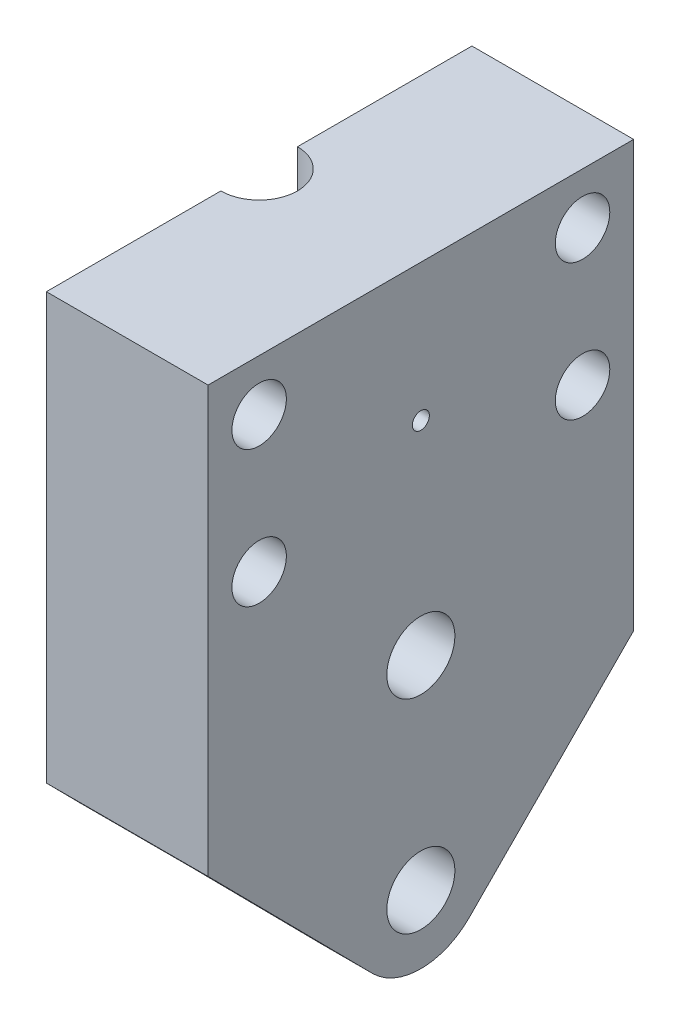
ISO-10303-21;
HEADER;
FILE_DESCRIPTION(('STEP AP214'),'2;1');
FILE_NAME('part.step','',(''),(''),'','','');
FILE_SCHEMA(('AUTOMOTIVE_DESIGN { 1 0 10303 214 1 1 1 1 }'));
ENDSEC;
DATA;
#1=APPLICATION_CONTEXT('core data for automotive mechanical design processes');
#2=APPLICATION_PROTOCOL_DEFINITION('international standard','automotive_design',2000,#1);
#3=PRODUCT_CONTEXT('',#1,'mechanical');
#4=PRODUCT('Part','Part','',(#3));
#5=PRODUCT_RELATED_PRODUCT_CATEGORY('part','',(#4));
#6=PRODUCT_DEFINITION_FORMATION('','',#4);
#7=PRODUCT_DEFINITION_CONTEXT('part definition',#1,'design');
#8=PRODUCT_DEFINITION('design','',#6,#7);
#9=PRODUCT_DEFINITION_SHAPE('','',#8);
#10=(LENGTH_UNIT() NAMED_UNIT(*) SI_UNIT(.MILLI.,.METRE.));
#11=(NAMED_UNIT(*) PLANE_ANGLE_UNIT() SI_UNIT($,.RADIAN.));
#12=(NAMED_UNIT(*) SI_UNIT($,.STERADIAN.) SOLID_ANGLE_UNIT());
#13=UNCERTAINTY_MEASURE_WITH_UNIT(LENGTH_MEASURE(1.E-05),#10,'distance_accuracy_value','');
#14=(GEOMETRIC_REPRESENTATION_CONTEXT(3) GLOBAL_UNCERTAINTY_ASSIGNED_CONTEXT((#13)) GLOBAL_UNIT_ASSIGNED_CONTEXT((#10,
#11,#12)) REPRESENTATION_CONTEXT('',''));
#15=CARTESIAN_POINT('',(0.,0.,0.));
#16=DIRECTION('',(0.,0.,1.));
#17=DIRECTION('',(1.,0.,0.));
#18=AXIS2_PLACEMENT_3D('',#15,#16,#17);
#19=CARTESIAN_POINT('',(0.,0.,0.));
#20=DIRECTION('',(1.,0.,0.));
#21=DIRECTION('',(0.,0.,-1.));
#22=AXIS2_PLACEMENT_3D('',#19,#20,#21);
#23=PLANE('',#22);
#24=CARTESIAN_POINT('',(0.,17.,-9.5));
#25=DIRECTION('',(1.,0.,0.));
#26=DIRECTION('',(0.,0.,-1.));
#27=AXIS2_PLACEMENT_3D('',#24,#25,#26);
#28=CIRCLE('',#27,1.6);
#29=CARTESIAN_POINT('',(0.,17.,-11.1));
#30=VERTEX_POINT('',#29);
#31=EDGE_CURVE('E219',#30,#30,#28,.T.);
#32=ORIENTED_EDGE('',*,*,#31,.T.);
#33=EDGE_LOOP('',(#32));
#34=FACE_BOUND('',#33,.T.);
#35=CARTESIAN_POINT('',(0.,9.,-9.5));
#36=DIRECTION('',(1.,0.,0.));
#37=DIRECTION('',(0.,0.,-1.));
#38=AXIS2_PLACEMENT_3D('',#35,#36,#37);
#39=CIRCLE('',#38,1.6);
#40=CARTESIAN_POINT('',(0.,9.,-11.1));
#41=VERTEX_POINT('',#40);
#42=EDGE_CURVE('E201',#41,#41,#39,.T.);
#43=ORIENTED_EDGE('',*,*,#42,.T.);
#44=EDGE_LOOP('',(#43));
#45=FACE_BOUND('',#44,.T.);
#46=DIRECTION('',(0.,1.,0.));
#47=VECTOR('',#46,1.);
#48=CARTESIAN_POINT('',(0.,14.,-2.25));
#49=LINE('',#48,#47);
#50=CARTESIAN_POINT('',(0.,20.,-2.25));
#51=VERTEX_POINT('',#50);
#52=CARTESIAN_POINT('',(0.,16.95,-2.25));
#53=VERTEX_POINT('',#52);
#54=EDGE_CURVE('E57',#51,#53,#49,.F.);
#55=ORIENTED_EDGE('',*,*,#54,.F.);
#56=DIRECTION('',(0.,0.,1.));
#57=VECTOR('',#56,1.);
#58=CARTESIAN_POINT('',(0.,20.,0.));
#59=LINE('',#58,#57);
#60=CARTESIAN_POINT('',(0.,20.,-12.5));
#61=VERTEX_POINT('',#60);
#62=EDGE_CURVE('E164',#61,#51,#59,.T.);
#63=ORIENTED_EDGE('',*,*,#62,.F.);
#64=DIRECTION('',(0.,1.,0.));
#65=VECTOR('',#64,1.);
#66=CARTESIAN_POINT('',(0.,0.,-12.5));
#67=LINE('',#66,#65);
#68=CARTESIAN_POINT('',(0.,-5.,-12.5));
#69=VERTEX_POINT('',#68);
#70=EDGE_CURVE('E179',#69,#61,#67,.T.);
#71=ORIENTED_EDGE('',*,*,#70,.F.);
#72=DIRECTION('',(0.,-0.710972936771414,0.703219370594007));
#73=VECTOR('',#72,1.);
#74=CARTESIAN_POINT('',(0.,-8.72221167971524,-8.81838116579595));
#75=LINE('',#74,#73);
#76=CARTESIAN_POINT('',(0.,-7.09701164045243,-10.4258574698725));
#77=VERTEX_POINT('',#76);
#78=EDGE_CURVE('E323',#69,#77,#75,.T.);
#79=ORIENTED_EDGE('',*,*,#78,.T.);
#80=CARTESIAN_POINT('',(0.,-11.95,0.));
#81=DIRECTION('',(1.,0.,0.));
#82=DIRECTION('',(0.,0.,-1.));
#83=AXIS2_PLACEMENT_3D('',#80,#81,#82);
#84=CIRCLE('',#83,11.5);
#85=CARTESIAN_POINT('',(0.,-4.62562761506277,-8.86586539299852));
#86=VERTEX_POINT('',#85);
#87=EDGE_CURVE('E281',#77,#86,#84,.T.);
#88=ORIENTED_EDGE('',*,*,#87,.T.);
#89=CARTESIAN_POINT('',(0.,0.,0.));
#90=DIRECTION('',(1.,0.,0.));
#91=DIRECTION('',(0.,0.,-1.));
#92=AXIS2_PLACEMENT_3D('',#89,#90,#91);
#93=CIRCLE('',#92,10.);
#94=CARTESIAN_POINT('',(0.,8.10889121338912,-5.85199823046971));
#95=VERTEX_POINT('',#94);
#96=EDGE_CURVE('E247',#86,#95,#93,.T.);
#97=ORIENTED_EDGE('',*,*,#96,.T.);
#98=CARTESIAN_POINT('',(0.,11.95,0.));
#99=DIRECTION('',(1.,0.,0.));
#100=DIRECTION('',(0.,0.,-1.));
#101=AXIS2_PLACEMENT_3D('',#98,#99,#100);
#102=CIRCLE('',#101,7.);
#103=CARTESIAN_POINT('',(0.,16.95,-4.89897948556636));
#104=VERTEX_POINT('',#103);
#105=EDGE_CURVE('E273',#95,#104,#102,.T.);
#106=ORIENTED_EDGE('',*,*,#105,.T.);
#107=DIRECTION('',(0.,0.,1.));
#108=VECTOR('',#107,1.);
#109=CARTESIAN_POINT('',(0.,16.95,0.));
#110=LINE('',#109,#108);
#111=EDGE_CURVE('E166',#104,#53,#110,.T.);
#112=ORIENTED_EDGE('',*,*,#111,.T.);
#113=EDGE_LOOP('',(#55,#63,#71,#79,#88,#97,#106,#112));
#114=FACE_BOUND('',#113,.T.);
#115=ADVANCED_FACE('F40',(#34,#45,#114),#23,.F.);
#116=CARTESIAN_POINT('',(0.,17.,9.5));
#117=DIRECTION('',(1.,0.,0.));
#118=DIRECTION('',(0.,0.,-1.));
#119=AXIS2_PLACEMENT_3D('',#116,#117,#118);
#120=CIRCLE('',#119,1.6);
#121=CARTESIAN_POINT('',(0.,17.,7.9));
#122=VERTEX_POINT('',#121);
#123=EDGE_CURVE('E221',#122,#122,#120,.T.);
#124=ORIENTED_EDGE('',*,*,#123,.T.);
#125=EDGE_LOOP('',(#124));
#126=FACE_BOUND('',#125,.T.);
#127=CARTESIAN_POINT('',(0.,9.,9.5));
#128=DIRECTION('',(1.,0.,0.));
#129=DIRECTION('',(0.,0.,-1.));
#130=AXIS2_PLACEMENT_3D('',#127,#128,#129);
#131=CIRCLE('',#130,1.6);
#132=CARTESIAN_POINT('',(0.,9.,7.9));
#133=VERTEX_POINT('',#132);
#134=EDGE_CURVE('E224',#133,#133,#131,.T.);
#135=ORIENTED_EDGE('',*,*,#134,.T.);
#136=EDGE_LOOP('',(#135));
#137=FACE_BOUND('',#136,.T.);
#138=DIRECTION('',(0.,1.,0.));
#139=VECTOR('',#138,1.);
#140=CARTESIAN_POINT('',(0.,14.,2.25));
#141=LINE('',#140,#139);
#142=CARTESIAN_POINT('',(0.,16.95,2.25));
#143=VERTEX_POINT('',#142);
#144=CARTESIAN_POINT('',(0.,20.,2.25));
#145=VERTEX_POINT('',#144);
#146=EDGE_CURVE('E155',#143,#145,#141,.T.);
#147=ORIENTED_EDGE('',*,*,#146,.F.);
#148=CARTESIAN_POINT('',(0.,16.95,4.89897948556636));
#149=VERTEX_POINT('',#148);
#150=EDGE_CURVE('E64',#143,#149,#110,.T.);
#151=ORIENTED_EDGE('',*,*,#150,.T.);
#152=CARTESIAN_POINT('',(0.,8.10889121338912,5.85199823046972));
#153=VERTEX_POINT('',#152);
#154=EDGE_CURVE('E242',#149,#153,#102,.T.);
#155=ORIENTED_EDGE('',*,*,#154,.T.);
#156=CARTESIAN_POINT('',(0.,0.,0.));
#157=DIRECTION('',(1.,0.,0.));
#158=DIRECTION('',(0.,0.,-1.));
#159=AXIS2_PLACEMENT_3D('',#156,#157,#158);
#160=CIRCLE('',#159,10.);
#161=CARTESIAN_POINT('',(0.,-4.62562761506277,8.86586539299852));
#162=VERTEX_POINT('',#161);
#163=EDGE_CURVE('E275',#153,#162,#160,.T.);
#164=ORIENTED_EDGE('',*,*,#163,.T.);
#165=CARTESIAN_POINT('',(0.,-11.95,0.));
#166=DIRECTION('',(1.,0.,0.));
#167=DIRECTION('',(0.,0.,-1.));
#168=AXIS2_PLACEMENT_3D('',#165,#166,#167);
#169=CIRCLE('',#168,11.5);
#170=CARTESIAN_POINT('',(0.,-7.09701164045243,10.4258574698725));
#171=VERTEX_POINT('',#170);
#172=EDGE_CURVE('E278',#162,#171,#169,.T.);
#173=ORIENTED_EDGE('',*,*,#172,.T.);
#174=DIRECTION('',(0.,-0.710972936771414,-0.703219370594007));
#175=VECTOR('',#174,1.);
#176=CARTESIAN_POINT('',(0.,-8.72221167971524,8.81838116579595));
#177=LINE('',#176,#175);
#178=CARTESIAN_POINT('',(0.,-5.,12.5));
#179=VERTEX_POINT('',#178);
#180=EDGE_CURVE('E321',#179,#171,#177,.T.);
#181=ORIENTED_EDGE('',*,*,#180,.F.);
#182=DIRECTION('',(0.,1.,0.));
#183=VECTOR('',#182,1.);
#184=CARTESIAN_POINT('',(0.,0.,12.5));
#185=LINE('',#184,#183);
#186=CARTESIAN_POINT('',(0.,20.,12.5));
#187=VERTEX_POINT('',#186);
#188=EDGE_CURVE('E299',#179,#187,#185,.T.);
#189=ORIENTED_EDGE('',*,*,#188,.T.);
#190=EDGE_CURVE('E174',#145,#187,#59,.T.);
#191=ORIENTED_EDGE('',*,*,#190,.F.);
#192=EDGE_LOOP('',(#147,#151,#155,#164,#173,#181,#189,#191));
#193=FACE_BOUND('',#192,.T.);
#194=ADVANCED_FACE('F364',(#126,#137,#193),#23,.F.);
#195=CARTESIAN_POINT('',(9.5,-8.72221167971524,8.81838116579595));
#196=DIRECTION('',(0.,0.703219370594007,-0.710972936771414));
#197=DIRECTION('',(0.,0.710972936771414,0.703219370594007));
#198=AXIS2_PLACEMENT_3D('',#195,#196,#197);
#199=PLANE('',#198);
#200=DIRECTION('',(-1.,0.,0.));
#201=VECTOR('',#200,1.);
#202=CARTESIAN_POINT('',(6.5,-7.09701164045243,10.4258574698725));
#203=LINE('',#202,#201);
#204=CARTESIAN_POINT('',(6.5,-7.09701164045243,10.4258574698725));
#205=VERTEX_POINT('',#204);
#206=EDGE_CURVE('E293',#205,#171,#203,.T.);
#207=ORIENTED_EDGE('',*,*,#206,.F.);
#208=DIRECTION('',(0.,-0.710972936771414,-0.703219370594007));
#209=VECTOR('',#208,1.);
#210=CARTESIAN_POINT('',(6.5,-8.72221167971524,8.81838116579595));
#211=LINE('',#210,#209);
#212=CARTESIAN_POINT('',(6.5,-14.7920702087868,2.81471791274485));
#213=VERTEX_POINT('',#212);
#214=EDGE_CURVE('E260',#205,#213,#211,.T.);
#215=ORIENTED_EDGE('',*,*,#214,.T.);
#216=DIRECTION('',(-1.,0.,0.));
#217=VECTOR('',#216,1.);
#218=CARTESIAN_POINT('',(9.5,-14.7920702087868,2.81471791274485));
#219=LINE('',#218,#217);
#220=CARTESIAN_POINT('',(9.5,-14.7920702087868,2.81471791274485));
#221=VERTEX_POINT('',#220);
#222=EDGE_CURVE('E193',#221,#213,#219,.T.);
#223=ORIENTED_EDGE('',*,*,#222,.F.);
#224=DIRECTION('',(0.,-0.710972936771414,-0.703219370594007));
#225=VECTOR('',#224,1.);
#226=CARTESIAN_POINT('',(9.5,-8.72221167971524,8.81838116579595));
#227=LINE('',#226,#225);
#228=CARTESIAN_POINT('',(9.5,-5.,12.5));
#229=VERTEX_POINT('',#228);
#230=EDGE_CURVE('E177',#229,#221,#227,.T.);
#231=ORIENTED_EDGE('',*,*,#230,.F.);
#232=DIRECTION('',(-1.,0.,0.));
#233=VECTOR('',#232,1.);
#234=CARTESIAN_POINT('',(9.5,-5.,12.5));
#235=LINE('',#234,#233);
#236=EDGE_CURVE('E49',#229,#179,#235,.T.);
#237=ORIENTED_EDGE('',*,*,#236,.T.);
#238=ORIENTED_EDGE('',*,*,#180,.T.);
#239=EDGE_LOOP('',(#207,#215,#223,#231,#237,#238));
#240=FACE_BOUND('',#239,.T.);
#241=ADVANCED_FACE('F369',(#240),#199,.F.);
#242=CARTESIAN_POINT('',(9.5,-8.72221167971524,-8.81838116579595));
#243=DIRECTION('',(0.,-0.703219370594007,-0.710972936771414));
#244=DIRECTION('',(0.,0.710972936771414,-0.703219370594007));
#245=AXIS2_PLACEMENT_3D('',#242,#243,#244);
#246=PLANE('',#245);
#247=DIRECTION('',(0.,-0.710972936771414,0.703219370594007));
#248=VECTOR('',#247,1.);
#249=CARTESIAN_POINT('',(6.5,-8.72221167971524,-8.81838116579595));
#250=LINE('',#249,#248);
#251=CARTESIAN_POINT('',(6.5,-7.09701164045243,-10.4258574698725));
#252=VERTEX_POINT('',#251);
#253=CARTESIAN_POINT('',(6.5,-14.7920702087868,-2.81471791274485));
#254=VERTEX_POINT('',#253);
#255=EDGE_CURVE('E266',#252,#254,#250,.T.);
#256=ORIENTED_EDGE('',*,*,#255,.F.);
#257=DIRECTION('',(-1.,0.,0.));
#258=VECTOR('',#257,1.);
#259=CARTESIAN_POINT('',(6.5,-7.09701164045243,-10.4258574698725));
#260=LINE('',#259,#258);
#261=EDGE_CURVE('E290',#252,#77,#260,.T.);
#262=ORIENTED_EDGE('',*,*,#261,.T.);
#263=ORIENTED_EDGE('',*,*,#78,.F.);
#264=DIRECTION('',(-1.,0.,0.));
#265=VECTOR('',#264,1.);
#266=CARTESIAN_POINT('',(9.5,-5.,-12.5));
#267=LINE('',#266,#265);
#268=CARTESIAN_POINT('',(9.5,-5.,-12.5));
#269=VERTEX_POINT('',#268);
#270=EDGE_CURVE('E188',#269,#69,#267,.T.);
#271=ORIENTED_EDGE('',*,*,#270,.F.);
#272=DIRECTION('',(0.,-0.710972936771414,0.703219370594007));
#273=VECTOR('',#272,1.);
#274=CARTESIAN_POINT('',(9.5,-8.72221167971524,-8.81838116579595));
#275=LINE('',#274,#273);
#276=CARTESIAN_POINT('',(9.5,-14.7920702087868,-2.81471791274485));
#277=VERTEX_POINT('',#276);
#278=EDGE_CURVE('E304',#269,#277,#275,.T.);
#279=ORIENTED_EDGE('',*,*,#278,.T.);
#280=DIRECTION('',(-1.,0.,0.));
#281=VECTOR('',#280,1.);
#282=CARTESIAN_POINT('',(9.5,-14.7920702087868,-2.81471791274485));
#283=LINE('',#282,#281);
#284=EDGE_CURVE('E190',#277,#254,#283,.T.);
#285=ORIENTED_EDGE('',*,*,#284,.T.);
#286=EDGE_LOOP('',(#256,#262,#263,#271,#279,#285));
#287=FACE_BOUND('',#286,.T.);
#288=ADVANCED_FACE('F331',(#287),#246,.T.);
#289=CARTESIAN_POINT('',(9.5,0.,12.5));
#290=DIRECTION('',(0.,0.,1.));
#291=DIRECTION('',(1.,0.,0.));
#292=AXIS2_PLACEMENT_3D('',#289,#290,#291);
#293=PLANE('',#292);
#294=ORIENTED_EDGE('',*,*,#188,.F.);
#295=ORIENTED_EDGE('',*,*,#236,.F.);
#296=DIRECTION('',(0.,1.,0.));
#297=VECTOR('',#296,1.);
#298=CARTESIAN_POINT('',(9.5,0.,12.5));
#299=LINE('',#298,#297);
#300=CARTESIAN_POINT('',(9.5,20.,12.5));
#301=VERTEX_POINT('',#300);
#302=EDGE_CURVE('E173',#229,#301,#299,.T.);
#303=ORIENTED_EDGE('',*,*,#302,.T.);
#304=DIRECTION('',(-1.,0.,0.));
#305=VECTOR('',#304,1.);
#306=CARTESIAN_POINT('',(9.5,20.,12.5));
#307=LINE('',#306,#305);
#308=EDGE_CURVE('E183',#301,#187,#307,.T.);
#309=ORIENTED_EDGE('',*,*,#308,.T.);
#310=EDGE_LOOP('',(#294,#295,#303,#309));
#311=FACE_BOUND('',#310,.T.);
#312=ADVANCED_FACE('F42',(#311),#293,.T.);
#313=CARTESIAN_POINT('',(9.5,-11.95,0.));
#314=DIRECTION('',(-1.,0.,0.));
#315=DIRECTION('',(0.,0.,1.));
#316=AXIS2_PLACEMENT_3D('',#313,#314,#315);
#317=CYLINDRICAL_SURFACE('',#316,4.00000000000001);
#318=ORIENTED_EDGE('',*,*,#222,.T.);
#319=CARTESIAN_POINT('',(6.5,-11.95,0.));
#320=DIRECTION('',(1.,0.,0.));
#321=DIRECTION('',(0.,0.,-1.));
#322=AXIS2_PLACEMENT_3D('',#319,#320,#321);
#323=CIRCLE('',#322,4.00000000000001);
#324=EDGE_CURVE('E263',#213,#254,#323,.T.);
#325=ORIENTED_EDGE('',*,*,#324,.T.);
#326=ORIENTED_EDGE('',*,*,#284,.F.);
#327=CARTESIAN_POINT('',(9.5,-11.95,0.));
#328=DIRECTION('',(1.,0.,0.));
#329=DIRECTION('',(0.,0.,-1.));
#330=AXIS2_PLACEMENT_3D('',#327,#328,#329);
#331=CIRCLE('',#330,4.00000000000001);
#332=EDGE_CURVE('E302',#221,#277,#331,.T.);
#333=ORIENTED_EDGE('',*,*,#332,.F.);
#334=EDGE_LOOP('',(#318,#325,#326,#333));
#335=FACE_BOUND('',#334,.T.);
#336=ADVANCED_FACE('F391',(#335),#317,.T.);
#337=CARTESIAN_POINT('',(9.5,0.,-12.5));
#338=DIRECTION('',(0.,0.,1.));
#339=DIRECTION('',(1.,0.,0.));
#340=AXIS2_PLACEMENT_3D('',#337,#338,#339);
#341=PLANE('',#340);
#342=ORIENTED_EDGE('',*,*,#70,.T.);
#343=DIRECTION('',(-1.,0.,0.));
#344=VECTOR('',#343,1.);
#345=CARTESIAN_POINT('',(9.5,20.,-12.5));
#346=LINE('',#345,#344);
#347=CARTESIAN_POINT('',(9.5,20.,-12.5));
#348=VERTEX_POINT('',#347);
#349=EDGE_CURVE('E172',#348,#61,#346,.T.);
#350=ORIENTED_EDGE('',*,*,#349,.F.);
#351=DIRECTION('',(0.,1.,0.));
#352=VECTOR('',#351,1.);
#353=CARTESIAN_POINT('',(9.5,0.,-12.5));
#354=LINE('',#353,#352);
#355=EDGE_CURVE('E307',#269,#348,#354,.T.);
#356=ORIENTED_EDGE('',*,*,#355,.F.);
#357=ORIENTED_EDGE('',*,*,#270,.T.);
#358=EDGE_LOOP('',(#342,#350,#356,#357));
#359=FACE_BOUND('',#358,.T.);
#360=ADVANCED_FACE('F327',(#359),#341,.F.);
#361=CARTESIAN_POINT('',(9.5,0.,0.));
#362=DIRECTION('',(-1.,0.,0.));
#363=DIRECTION('',(0.,0.,1.));
#364=AXIS2_PLACEMENT_3D('',#361,#362,#363);
#365=CYLINDRICAL_SURFACE('',#364,2.);
#366=CARTESIAN_POINT('',(6.5,0.,0.));
#367=DIRECTION('',(1.,0.,0.));
#368=DIRECTION('',(0.,0.,-1.));
#369=AXIS2_PLACEMENT_3D('',#366,#367,#368);
#370=CIRCLE('',#369,2.);
#371=CARTESIAN_POINT('',(6.5,0.,-2.));
#372=VERTEX_POINT('',#371);
#373=EDGE_CURVE('E246',#372,#372,#370,.T.);
#374=ORIENTED_EDGE('',*,*,#373,.F.);
#375=EDGE_LOOP('',(#374));
#376=FACE_BOUND('',#375,.T.);
#377=CARTESIAN_POINT('',(9.5,0.,0.));
#378=DIRECTION('',(1.,0.,0.));
#379=DIRECTION('',(0.,0.,-1.));
#380=AXIS2_PLACEMENT_3D('',#377,#378,#379);
#381=CIRCLE('',#380,2.);
#382=CARTESIAN_POINT('',(9.5,0.,-2.));
#383=VERTEX_POINT('',#382);
#384=EDGE_CURVE('E314',#383,#383,#381,.T.);
#385=ORIENTED_EDGE('',*,*,#384,.T.);
#386=EDGE_LOOP('',(#385));
#387=FACE_BOUND('',#386,.T.);
#388=ADVANCED_FACE('F379',(#376,#387),#365,.F.);
#389=CARTESIAN_POINT('',(9.5,11.95,0.));
#390=DIRECTION('',(-1.,0.,0.));
#391=DIRECTION('',(0.,0.,1.));
#392=AXIS2_PLACEMENT_3D('',#389,#390,#391);
#393=CYLINDRICAL_SURFACE('',#392,0.5);
#394=CARTESIAN_POINT('',(6.5,11.95,0.));
#395=DIRECTION('',(1.,0.,0.));
#396=DIRECTION('',(0.,0.,-1.));
#397=AXIS2_PLACEMENT_3D('',#394,#395,#396);
#398=CIRCLE('',#397,0.5);
#399=CARTESIAN_POINT('',(6.5,11.95,-0.499999999999996));
#400=VERTEX_POINT('',#399);
#401=EDGE_CURVE('E243',#400,#400,#398,.T.);
#402=ORIENTED_EDGE('',*,*,#401,.F.);
#403=EDGE_LOOP('',(#402));
#404=FACE_BOUND('',#403,.T.);
#405=CARTESIAN_POINT('',(9.5,11.95,0.));
#406=DIRECTION('',(1.,0.,0.));
#407=DIRECTION('',(0.,0.,-1.));
#408=AXIS2_PLACEMENT_3D('',#405,#406,#407);
#409=CIRCLE('',#408,0.5);
#410=CARTESIAN_POINT('',(9.5,11.95,-0.499999999999996));
#411=VERTEX_POINT('',#410);
#412=EDGE_CURVE('E311',#411,#411,#409,.T.);
#413=ORIENTED_EDGE('',*,*,#412,.T.);
#414=EDGE_LOOP('',(#413));
#415=FACE_BOUND('',#414,.T.);
#416=ADVANCED_FACE('F382',(#404,#415),#393,.F.);
#417=CARTESIAN_POINT('',(9.5,20.,0.));
#418=DIRECTION('',(0.,-1.,0.));
#419=DIRECTION('',(0.,0.,-1.));
#420=AXIS2_PLACEMENT_3D('',#417,#418,#419);
#421=PLANE('',#420);
#422=CARTESIAN_POINT('',(0.,20.,0.));
#423=DIRECTION('',(0.,-1.,0.));
#424=DIRECTION('',(0.,0.,-1.));
#425=AXIS2_PLACEMENT_3D('',#422,#423,#424);
#426=CIRCLE('',#425,2.25);
#427=EDGE_CURVE('E153',#51,#145,#426,.T.);
#428=ORIENTED_EDGE('',*,*,#427,.T.);
#429=ORIENTED_EDGE('',*,*,#190,.T.);
#430=ORIENTED_EDGE('',*,*,#308,.F.);
#431=DIRECTION('',(0.,0.,1.));
#432=VECTOR('',#431,1.);
#433=CARTESIAN_POINT('',(9.5,20.,0.));
#434=LINE('',#433,#432);
#435=EDGE_CURVE('E309',#348,#301,#434,.T.);
#436=ORIENTED_EDGE('',*,*,#435,.F.);
#437=ORIENTED_EDGE('',*,*,#349,.T.);
#438=ORIENTED_EDGE('',*,*,#62,.T.);
#439=EDGE_LOOP('',(#428,#429,#430,#436,#437,#438));
#440=FACE_BOUND('',#439,.T.);
#441=ADVANCED_FACE('F169',(#440),#421,.F.);
#442=CARTESIAN_POINT('',(9.5,-11.95,0.));
#443=DIRECTION('',(-1.,0.,0.));
#444=DIRECTION('',(0.,0.,1.));
#445=AXIS2_PLACEMENT_3D('',#442,#443,#444);
#446=CYLINDRICAL_SURFACE('',#445,2.);
#447=CARTESIAN_POINT('',(6.5,-11.95,0.));
#448=DIRECTION('',(1.,0.,0.));
#449=DIRECTION('',(0.,0.,-1.));
#450=AXIS2_PLACEMENT_3D('',#447,#448,#449);
#451=CIRCLE('',#450,2.);
#452=CARTESIAN_POINT('',(6.5,-11.95,-2.));
#453=VERTEX_POINT('',#452);
#454=EDGE_CURVE('E250',#453,#453,#451,.T.);
#455=ORIENTED_EDGE('',*,*,#454,.F.);
#456=EDGE_LOOP('',(#455));
#457=FACE_BOUND('',#456,.T.);
#458=CARTESIAN_POINT('',(9.5,-11.95,0.));
#459=DIRECTION('',(1.,0.,0.));
#460=DIRECTION('',(0.,0.,-1.));
#461=AXIS2_PLACEMENT_3D('',#458,#459,#460);
#462=CIRCLE('',#461,2.);
#463=CARTESIAN_POINT('',(9.5,-11.95,-2.));
#464=VERTEX_POINT('',#463);
#465=EDGE_CURVE('E186',#464,#464,#462,.T.);
#466=ORIENTED_EDGE('',*,*,#465,.T.);
#467=EDGE_LOOP('',(#466));
#468=FACE_BOUND('',#467,.T.);
#469=ADVANCED_FACE('F375',(#457,#468),#446,.F.);
#470=CARTESIAN_POINT('',(9.5,0.,0.));
#471=DIRECTION('',(1.,0.,0.));
#472=DIRECTION('',(0.,0.,-1.));
#473=AXIS2_PLACEMENT_3D('',#470,#471,#472);
#474=PLANE('',#473);
#475=CARTESIAN_POINT('',(9.5,17.,-9.5));
#476=DIRECTION('',(1.,0.,0.));
#477=DIRECTION('',(0.,0.,-1.));
#478=AXIS2_PLACEMENT_3D('',#475,#476,#477);
#479=CIRCLE('',#478,1.6);
#480=CARTESIAN_POINT('',(9.5,17.,-11.1));
#481=VERTEX_POINT('',#480);
#482=EDGE_CURVE('E44',#481,#481,#479,.F.);
#483=ORIENTED_EDGE('',*,*,#482,.T.);
#484=EDGE_LOOP('',(#483));
#485=FACE_BOUND('',#484,.T.);
#486=CARTESIAN_POINT('',(9.5,17.,9.5));
#487=DIRECTION('',(1.,0.,0.));
#488=DIRECTION('',(0.,0.,-1.));
#489=AXIS2_PLACEMENT_3D('',#486,#487,#488);
#490=CIRCLE('',#489,1.6);
#491=CARTESIAN_POINT('',(9.5,17.,7.9));
#492=VERTEX_POINT('',#491);
#493=EDGE_CURVE('E203',#492,#492,#490,.F.);
#494=ORIENTED_EDGE('',*,*,#493,.T.);
#495=EDGE_LOOP('',(#494));
#496=FACE_BOUND('',#495,.T.);
#497=CARTESIAN_POINT('',(9.5,9.,9.5));
#498=DIRECTION('',(1.,0.,0.));
#499=DIRECTION('',(0.,0.,-1.));
#500=AXIS2_PLACEMENT_3D('',#497,#498,#499);
#501=CIRCLE('',#500,1.6);
#502=CARTESIAN_POINT('',(9.5,9.,7.9));
#503=VERTEX_POINT('',#502);
#504=EDGE_CURVE('E200',#503,#503,#501,.F.);
#505=ORIENTED_EDGE('',*,*,#504,.T.);
#506=EDGE_LOOP('',(#505));
#507=FACE_BOUND('',#506,.T.);
#508=CARTESIAN_POINT('',(9.5,9.,-9.5));
#509=DIRECTION('',(1.,0.,0.));
#510=DIRECTION('',(0.,0.,-1.));
#511=AXIS2_PLACEMENT_3D('',#508,#509,#510);
#512=CIRCLE('',#511,1.6);
#513=CARTESIAN_POINT('',(9.5,9.,-11.1));
#514=VERTEX_POINT('',#513);
#515=EDGE_CURVE('E197',#514,#514,#512,.F.);
#516=ORIENTED_EDGE('',*,*,#515,.T.);
#517=EDGE_LOOP('',(#516));
#518=FACE_BOUND('',#517,.T.);
#519=ORIENTED_EDGE('',*,*,#302,.F.);
#520=ORIENTED_EDGE('',*,*,#230,.T.);
#521=ORIENTED_EDGE('',*,*,#332,.T.);
#522=ORIENTED_EDGE('',*,*,#278,.F.);
#523=ORIENTED_EDGE('',*,*,#355,.T.);
#524=ORIENTED_EDGE('',*,*,#435,.T.);
#525=EDGE_LOOP('',(#519,#520,#521,#522,#523,#524));
#526=FACE_BOUND('',#525,.T.);
#527=ORIENTED_EDGE('',*,*,#412,.F.);
#528=EDGE_LOOP('',(#527));
#529=FACE_BOUND('',#528,.T.);
#530=ORIENTED_EDGE('',*,*,#384,.F.);
#531=EDGE_LOOP('',(#530));
#532=FACE_BOUND('',#531,.T.);
#533=ORIENTED_EDGE('',*,*,#465,.F.);
#534=EDGE_LOOP('',(#533));
#535=FACE_BOUND('',#534,.T.);
#536=ADVANCED_FACE('F210',(#485,#496,#507,#518,#526,#529,#532,#535),#474,.T.);
#537=CARTESIAN_POINT('',(6.5,11.95,0.));
#538=DIRECTION('',(-1.,0.,0.));
#539=DIRECTION('',(0.,0.,1.));
#540=AXIS2_PLACEMENT_3D('',#537,#538,#539);
#541=CYLINDRICAL_SURFACE('',#540,7.);
#542=DIRECTION('',(-1.,0.,0.));
#543=VECTOR('',#542,1.);
#544=CARTESIAN_POINT('',(3.,16.95,4.89897948556636));
#545=LINE('',#544,#543);
#546=CARTESIAN_POINT('',(3.,16.95,4.89897948556636));
#547=VERTEX_POINT('',#546);
#548=EDGE_CURVE('E240',#547,#149,#545,.T.);
#549=ORIENTED_EDGE('',*,*,#548,.F.);
#550=CARTESIAN_POINT('',(3.,11.95,0.));
#551=DIRECTION('',(1.,0.,0.));
#552=DIRECTION('',(0.,0.,-1.));
#553=AXIS2_PLACEMENT_3D('',#550,#551,#552);
#554=CIRCLE('',#553,7.);
#555=CARTESIAN_POINT('',(3.,16.95,-4.89897948556636));
#556=VERTEX_POINT('',#555);
#557=EDGE_CURVE('E231',#556,#547,#554,.T.);
#558=ORIENTED_EDGE('',*,*,#557,.F.);
#559=DIRECTION('',(-1.,0.,0.));
#560=VECTOR('',#559,1.);
#561=CARTESIAN_POINT('',(3.,16.95,-4.89897948556636));
#562=LINE('',#561,#560);
#563=EDGE_CURVE('E236',#556,#104,#562,.T.);
#564=ORIENTED_EDGE('',*,*,#563,.T.);
#565=ORIENTED_EDGE('',*,*,#105,.F.);
#566=DIRECTION('',(-1.,0.,0.));
#567=VECTOR('',#566,1.);
#568=CARTESIAN_POINT('',(6.5,8.10889121338912,-5.85199823046971));
#569=LINE('',#568,#567);
#570=CARTESIAN_POINT('',(6.5,8.10889121338912,-5.85199823046971));
#571=VERTEX_POINT('',#570);
#572=EDGE_CURVE('E272',#571,#95,#569,.T.);
#573=ORIENTED_EDGE('',*,*,#572,.F.);
#574=CARTESIAN_POINT('',(6.5,11.95,0.));
#575=DIRECTION('',(1.,0.,0.));
#576=DIRECTION('',(0.,0.,-1.));
#577=AXIS2_PLACEMENT_3D('',#574,#575,#576);
#578=CIRCLE('',#577,7.);
#579=CARTESIAN_POINT('',(6.5,8.10889121338912,5.85199823046972));
#580=VERTEX_POINT('',#579);
#581=EDGE_CURVE('E253',#571,#580,#578,.T.);
#582=ORIENTED_EDGE('',*,*,#581,.T.);
#583=DIRECTION('',(-1.,0.,0.));
#584=VECTOR('',#583,1.);
#585=CARTESIAN_POINT('',(6.5,8.10889121338912,5.85199823046972));
#586=LINE('',#585,#584);
#587=EDGE_CURVE('E297',#580,#153,#586,.T.);
#588=ORIENTED_EDGE('',*,*,#587,.T.);
#589=ORIENTED_EDGE('',*,*,#154,.F.);
#590=EDGE_LOOP('',(#549,#558,#564,#565,#573,#582,#588,#589));
#591=FACE_BOUND('',#590,.T.);
#592=ADVANCED_FACE('F346',(#591),#541,.F.);
#593=CARTESIAN_POINT('',(6.5,0.,0.));
#594=DIRECTION('',(-1.,0.,0.));
#595=DIRECTION('',(0.,0.,1.));
#596=AXIS2_PLACEMENT_3D('',#593,#594,#595);
#597=CYLINDRICAL_SURFACE('',#596,10.);
#598=ORIENTED_EDGE('',*,*,#163,.F.);
#599=ORIENTED_EDGE('',*,*,#587,.F.);
#600=CARTESIAN_POINT('',(6.5,0.,0.));
#601=DIRECTION('',(1.,0.,0.));
#602=DIRECTION('',(0.,0.,-1.));
#603=AXIS2_PLACEMENT_3D('',#600,#601,#602);
#604=CIRCLE('',#603,10.);
#605=CARTESIAN_POINT('',(6.5,-4.62562761506277,8.86586539299852));
#606=VERTEX_POINT('',#605);
#607=EDGE_CURVE('E256',#580,#606,#604,.T.);
#608=ORIENTED_EDGE('',*,*,#607,.T.);
#609=DIRECTION('',(-1.,0.,0.));
#610=VECTOR('',#609,1.);
#611=CARTESIAN_POINT('',(6.5,-4.62562761506277,8.86586539299852));
#612=LINE('',#611,#610);
#613=EDGE_CURVE('E295',#606,#162,#612,.T.);
#614=ORIENTED_EDGE('',*,*,#613,.T.);
#615=EDGE_LOOP('',(#598,#599,#608,#614));
#616=FACE_BOUND('',#615,.T.);
#617=ADVANCED_FACE('F413',(#616),#597,.F.);
#618=CARTESIAN_POINT('',(6.5,-11.95,0.));
#619=DIRECTION('',(-1.,0.,0.));
#620=DIRECTION('',(0.,0.,1.));
#621=AXIS2_PLACEMENT_3D('',#618,#619,#620);
#622=CYLINDRICAL_SURFACE('',#621,11.5);
#623=ORIENTED_EDGE('',*,*,#172,.F.);
#624=ORIENTED_EDGE('',*,*,#613,.F.);
#625=CARTESIAN_POINT('',(6.5,-11.95,0.));
#626=DIRECTION('',(1.,0.,0.));
#627=DIRECTION('',(0.,0.,-1.));
#628=AXIS2_PLACEMENT_3D('',#625,#626,#627);
#629=CIRCLE('',#628,11.5);
#630=EDGE_CURVE('E258',#606,#205,#629,.T.);
#631=ORIENTED_EDGE('',*,*,#630,.T.);
#632=ORIENTED_EDGE('',*,*,#206,.T.);
#633=EDGE_LOOP('',(#623,#624,#631,#632));
#634=FACE_BOUND('',#633,.T.);
#635=ADVANCED_FACE('F406',(#634),#622,.F.);
#636=CARTESIAN_POINT('',(6.5,-11.95,0.));
#637=DIRECTION('',(-1.,0.,0.));
#638=DIRECTION('',(0.,0.,1.));
#639=AXIS2_PLACEMENT_3D('',#636,#637,#638);
#640=CYLINDRICAL_SURFACE('',#639,11.5);
#641=ORIENTED_EDGE('',*,*,#87,.F.);
#642=ORIENTED_EDGE('',*,*,#261,.F.);
#643=CARTESIAN_POINT('',(6.5,-11.95,0.));
#644=DIRECTION('',(1.,0.,0.));
#645=DIRECTION('',(0.,0.,-1.));
#646=AXIS2_PLACEMENT_3D('',#643,#644,#645);
#647=CIRCLE('',#646,11.5);
#648=CARTESIAN_POINT('',(6.5,-4.62562761506277,-8.86586539299852));
#649=VERTEX_POINT('',#648);
#650=EDGE_CURVE('E268',#252,#649,#647,.T.);
#651=ORIENTED_EDGE('',*,*,#650,.T.);
#652=DIRECTION('',(-1.,0.,0.));
#653=VECTOR('',#652,1.);
#654=CARTESIAN_POINT('',(6.5,-4.62562761506277,-8.86586539299852));
#655=LINE('',#654,#653);
#656=EDGE_CURVE('E288',#649,#86,#655,.T.);
#657=ORIENTED_EDGE('',*,*,#656,.T.);
#658=EDGE_LOOP('',(#641,#642,#651,#657));
#659=FACE_BOUND('',#658,.T.);
#660=ADVANCED_FACE('F334',(#659),#640,.F.);
#661=CARTESIAN_POINT('',(6.5,0.,0.));
#662=DIRECTION('',(-1.,0.,0.));
#663=DIRECTION('',(0.,0.,1.));
#664=AXIS2_PLACEMENT_3D('',#661,#662,#663);
#665=CYLINDRICAL_SURFACE('',#664,10.);
#666=ORIENTED_EDGE('',*,*,#96,.F.);
#667=ORIENTED_EDGE('',*,*,#656,.F.);
#668=CARTESIAN_POINT('',(6.5,0.,0.));
#669=DIRECTION('',(1.,0.,0.));
#670=DIRECTION('',(0.,0.,-1.));
#671=AXIS2_PLACEMENT_3D('',#668,#669,#670);
#672=CIRCLE('',#671,10.);
#673=EDGE_CURVE('E270',#649,#571,#672,.T.);
#674=ORIENTED_EDGE('',*,*,#673,.T.);
#675=ORIENTED_EDGE('',*,*,#572,.T.);
#676=EDGE_LOOP('',(#666,#667,#674,#675));
#677=FACE_BOUND('',#676,.T.);
#678=ADVANCED_FACE('F343',(#677),#665,.F.);
#679=CARTESIAN_POINT('',(6.5,0.,0.));
#680=DIRECTION('',(1.,0.,0.));
#681=DIRECTION('',(0.,0.,-1.));
#682=AXIS2_PLACEMENT_3D('',#679,#680,#681);
#683=PLANE('',#682);
#684=ORIENTED_EDGE('',*,*,#401,.T.);
#685=EDGE_LOOP('',(#684));
#686=FACE_BOUND('',#685,.T.);
#687=ORIENTED_EDGE('',*,*,#373,.T.);
#688=EDGE_LOOP('',(#687));
#689=FACE_BOUND('',#688,.T.);
#690=ORIENTED_EDGE('',*,*,#454,.T.);
#691=EDGE_LOOP('',(#690));
#692=FACE_BOUND('',#691,.T.);
#693=ORIENTED_EDGE('',*,*,#581,.F.);
#694=ORIENTED_EDGE('',*,*,#673,.F.);
#695=ORIENTED_EDGE('',*,*,#650,.F.);
#696=ORIENTED_EDGE('',*,*,#255,.T.);
#697=ORIENTED_EDGE('',*,*,#324,.F.);
#698=ORIENTED_EDGE('',*,*,#214,.F.);
#699=ORIENTED_EDGE('',*,*,#630,.F.);
#700=ORIENTED_EDGE('',*,*,#607,.F.);
#701=EDGE_LOOP('',(#693,#694,#695,#696,#697,#698,#699,#700));
#702=FACE_BOUND('',#701,.T.);
#703=ADVANCED_FACE('F339',(#686,#689,#692,#702),#683,.F.);
#704=CARTESIAN_POINT('',(3.,16.95,0.));
#705=DIRECTION('',(0.,-1.,0.));
#706=DIRECTION('',(0.,0.,-1.));
#707=AXIS2_PLACEMENT_3D('',#704,#705,#706);
#708=PLANE('',#707);
#709=ORIENTED_EDGE('',*,*,#150,.F.);
#710=CARTESIAN_POINT('',(0.,16.95,0.));
#711=DIRECTION('',(0.,-1.,0.));
#712=DIRECTION('',(0.,0.,-1.));
#713=AXIS2_PLACEMENT_3D('',#710,#711,#712);
#714=CIRCLE('',#713,2.25);
#715=EDGE_CURVE('E11',#143,#53,#714,.F.);
#716=ORIENTED_EDGE('',*,*,#715,.T.);
#717=ORIENTED_EDGE('',*,*,#111,.F.);
#718=ORIENTED_EDGE('',*,*,#563,.F.);
#719=DIRECTION('',(0.,0.,1.));
#720=VECTOR('',#719,1.);
#721=CARTESIAN_POINT('',(3.,16.95,0.));
#722=LINE('',#721,#720);
#723=EDGE_CURVE('E233',#556,#547,#722,.T.);
#724=ORIENTED_EDGE('',*,*,#723,.T.);
#725=ORIENTED_EDGE('',*,*,#548,.T.);
#726=EDGE_LOOP('',(#709,#716,#717,#718,#724,#725));
#727=FACE_BOUND('',#726,.T.);
#728=ADVANCED_FACE('F351',(#727),#708,.T.);
#729=CARTESIAN_POINT('',(3.,11.95,0.));
#730=DIRECTION('',(1.,0.,0.));
#731=DIRECTION('',(0.,0.,-1.));
#732=AXIS2_PLACEMENT_3D('',#729,#730,#731);
#733=PLANE('',#732);
#734=ORIENTED_EDGE('',*,*,#557,.T.);
#735=ORIENTED_EDGE('',*,*,#723,.F.);
#736=EDGE_LOOP('',(#734,#735));
#737=FACE_BOUND('',#736,.T.);
#738=ADVANCED_FACE('F353',(#737),#733,.T.);
#739=CARTESIAN_POINT('',(0.,14.,0.));
#740=DIRECTION('',(0.,1.,0.));
#741=DIRECTION('',(0.,0.,1.));
#742=AXIS2_PLACEMENT_3D('',#739,#740,#741);
#743=CYLINDRICAL_SURFACE('',#742,2.25);
#744=ORIENTED_EDGE('',*,*,#54,.T.);
#745=ORIENTED_EDGE('',*,*,#715,.F.);
#746=ORIENTED_EDGE('',*,*,#146,.T.);
#747=ORIENTED_EDGE('',*,*,#427,.F.);
#748=EDGE_LOOP('',(#744,#745,#746,#747));
#749=FACE_BOUND('',#748,.T.);
#750=ADVANCED_FACE('F154',(#749),#743,.F.);
#751=CARTESIAN_POINT('',(10.,9.,-9.5));
#752=DIRECTION('',(-1.,0.,0.));
#753=DIRECTION('',(0.,0.,1.));
#754=AXIS2_PLACEMENT_3D('',#751,#752,#753);
#755=CYLINDRICAL_SURFACE('',#754,1.6);
#756=ORIENTED_EDGE('',*,*,#515,.F.);
#757=EDGE_LOOP('',(#756));
#758=FACE_BOUND('',#757,.T.);
#759=ORIENTED_EDGE('',*,*,#42,.F.);
#760=EDGE_LOOP('',(#759));
#761=FACE_BOUND('',#760,.T.);
#762=ADVANCED_FACE('F360',(#758,#761),#755,.F.);
#763=CARTESIAN_POINT('',(10.,9.,9.5));
#764=DIRECTION('',(-1.,0.,0.));
#765=DIRECTION('',(0.,0.,1.));
#766=AXIS2_PLACEMENT_3D('',#763,#764,#765);
#767=CYLINDRICAL_SURFACE('',#766,1.6);
#768=ORIENTED_EDGE('',*,*,#504,.F.);
#769=EDGE_LOOP('',(#768));
#770=FACE_BOUND('',#769,.T.);
#771=ORIENTED_EDGE('',*,*,#134,.F.);
#772=EDGE_LOOP('',(#771));
#773=FACE_BOUND('',#772,.T.);
#774=ADVANCED_FACE('F499',(#770,#773),#767,.F.);
#775=CARTESIAN_POINT('',(10.,17.,9.5));
#776=DIRECTION('',(-1.,0.,0.));
#777=DIRECTION('',(0.,0.,1.));
#778=AXIS2_PLACEMENT_3D('',#775,#776,#777);
#779=CYLINDRICAL_SURFACE('',#778,1.6);
#780=ORIENTED_EDGE('',*,*,#493,.F.);
#781=EDGE_LOOP('',(#780));
#782=FACE_BOUND('',#781,.T.);
#783=ORIENTED_EDGE('',*,*,#123,.F.);
#784=EDGE_LOOP('',(#783));
#785=FACE_BOUND('',#784,.T.);
#786=ADVANCED_FACE('F215',(#782,#785),#779,.F.);
#787=CARTESIAN_POINT('',(10.,17.,-9.5));
#788=DIRECTION('',(-1.,0.,0.));
#789=DIRECTION('',(0.,0.,1.));
#790=AXIS2_PLACEMENT_3D('',#787,#788,#789);
#791=CYLINDRICAL_SURFACE('',#790,1.6);
#792=ORIENTED_EDGE('',*,*,#482,.F.);
#793=EDGE_LOOP('',(#792));
#794=FACE_BOUND('',#793,.T.);
#795=ORIENTED_EDGE('',*,*,#31,.F.);
#796=EDGE_LOOP('',(#795));
#797=FACE_BOUND('',#796,.T.);
#798=ADVANCED_FACE('F212',(#794,#797),#791,.F.);
#799=CLOSED_SHELL('',(#115,#194,#241,#288,#312,#336,#360,#388,#416,#441,#469,#536,#592,#617,
#635,#660,#678,#703,#728,#738,#750,#762,#774,#786,#798));
#800=MANIFOLD_SOLID_BREP('B2',#799);
#801=ADVANCED_BREP_SHAPE_REPRESENTATION('',(#18,#800),#14);
#802=SHAPE_DEFINITION_REPRESENTATION(#9,#801);
ENDSEC;
END-ISO-10303-21;
